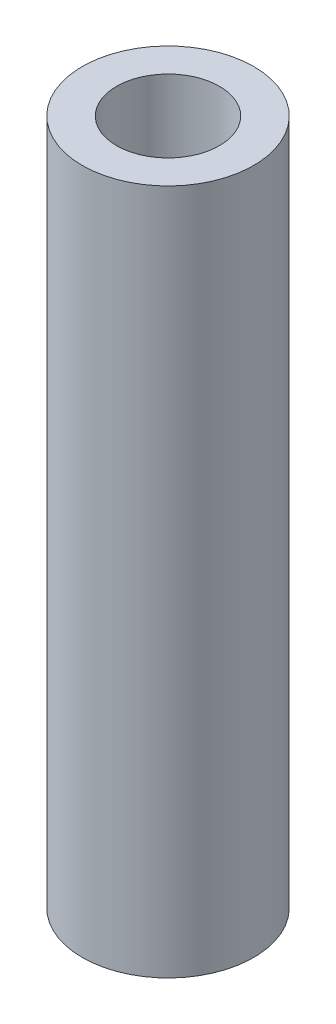
ISO-10303-21;
HEADER;
FILE_DESCRIPTION(('STEP AP214'),'2;1');
FILE_NAME('part.step','',(''),(''),'','','');
FILE_SCHEMA(('AUTOMOTIVE_DESIGN { 1 0 10303 214 1 1 1 1 }'));
ENDSEC;
DATA;
#1=APPLICATION_CONTEXT('core data for automotive mechanical design processes');
#2=APPLICATION_PROTOCOL_DEFINITION('international standard','automotive_design',2000,#1);
#3=PRODUCT_CONTEXT('',#1,'mechanical');
#4=PRODUCT('Part','Part','',(#3));
#5=PRODUCT_RELATED_PRODUCT_CATEGORY('part','',(#4));
#6=PRODUCT_DEFINITION_FORMATION('','',#4);
#7=PRODUCT_DEFINITION_CONTEXT('part definition',#1,'design');
#8=PRODUCT_DEFINITION('design','',#6,#7);
#9=PRODUCT_DEFINITION_SHAPE('','',#8);
#10=(LENGTH_UNIT() NAMED_UNIT(*) SI_UNIT(.MILLI.,.METRE.));
#11=(NAMED_UNIT(*) PLANE_ANGLE_UNIT() SI_UNIT($,.RADIAN.));
#12=(NAMED_UNIT(*) SI_UNIT($,.STERADIAN.) SOLID_ANGLE_UNIT());
#13=UNCERTAINTY_MEASURE_WITH_UNIT(LENGTH_MEASURE(1.E-05),#10,'distance_accuracy_value','');
#14=(GEOMETRIC_REPRESENTATION_CONTEXT(3) GLOBAL_UNCERTAINTY_ASSIGNED_CONTEXT((#13)) GLOBAL_UNIT_ASSIGNED_CONTEXT((#10,
#11,#12)) REPRESENTATION_CONTEXT('',''));
#15=CARTESIAN_POINT('',(0.,0.,0.));
#16=DIRECTION('',(0.,0.,1.));
#17=DIRECTION('',(1.,0.,0.));
#18=AXIS2_PLACEMENT_3D('',#15,#16,#17);
#19=CARTESIAN_POINT('',(0.,20.,0.));
#20=DIRECTION('',(0.,1.,0.));
#21=DIRECTION('',(0.,0.,1.));
#22=AXIS2_PLACEMENT_3D('',#19,#20,#21);
#23=PLANE('',#22);
#24=CARTESIAN_POINT('',(0.,20.,0.));
#25=DIRECTION('',(0.,1.,0.));
#26=DIRECTION('',(0.,0.,1.));
#27=AXIS2_PLACEMENT_3D('',#24,#25,#26);
#28=CIRCLE('',#27,2.5);
#29=CARTESIAN_POINT('',(0.,20.,2.5));
#30=VERTEX_POINT('',#29);
#31=EDGE_CURVE('E10',#30,#30,#28,.T.);
#32=ORIENTED_EDGE('',*,*,#31,.T.);
#33=EDGE_LOOP('',(#32));
#34=FACE_BOUND('',#33,.T.);
#35=CARTESIAN_POINT('',(0.,20.,0.));
#36=DIRECTION('',(0.,1.,0.));
#37=DIRECTION('',(0.,0.,1.));
#38=AXIS2_PLACEMENT_3D('',#35,#36,#37);
#39=CIRCLE('',#38,1.5);
#40=CARTESIAN_POINT('',(0.,20.,1.5));
#41=VERTEX_POINT('',#40);
#42=EDGE_CURVE('E47',#41,#41,#39,.T.);
#43=ORIENTED_EDGE('',*,*,#42,.F.);
#44=EDGE_LOOP('',(#43));
#45=FACE_BOUND('',#44,.T.);
#46=ADVANCED_FACE('F35',(#34,#45),#23,.T.);
#47=CARTESIAN_POINT('',(0.,0.,0.));
#48=DIRECTION('',(0.,1.,0.));
#49=DIRECTION('',(0.,0.,1.));
#50=AXIS2_PLACEMENT_3D('',#47,#48,#49);
#51=PLANE('',#50);
#52=CARTESIAN_POINT('',(0.,0.,0.));
#53=DIRECTION('',(0.,1.,0.));
#54=DIRECTION('',(0.,0.,1.));
#55=AXIS2_PLACEMENT_3D('',#52,#53,#54);
#56=CIRCLE('',#55,2.5);
#57=CARTESIAN_POINT('',(0.,0.,2.5));
#58=VERTEX_POINT('',#57);
#59=EDGE_CURVE('E39',#58,#58,#56,.T.);
#60=ORIENTED_EDGE('',*,*,#59,.F.);
#61=EDGE_LOOP('',(#60));
#62=FACE_BOUND('',#61,.T.);
#63=CARTESIAN_POINT('',(0.,0.,0.));
#64=DIRECTION('',(0.,1.,0.));
#65=DIRECTION('',(0.,0.,1.));
#66=AXIS2_PLACEMENT_3D('',#63,#64,#65);
#67=CIRCLE('',#66,1.5);
#68=CARTESIAN_POINT('',(0.,0.,1.5));
#69=VERTEX_POINT('',#68);
#70=EDGE_CURVE('E49',#69,#69,#67,.T.);
#71=ORIENTED_EDGE('',*,*,#70,.T.);
#72=EDGE_LOOP('',(#71));
#73=FACE_BOUND('',#72,.T.);
#74=ADVANCED_FACE('F60',(#62,#73),#51,.F.);
#75=CARTESIAN_POINT('',(0.,20.,0.));
#76=DIRECTION('',(0.,-1.,0.));
#77=DIRECTION('',(0.,0.,-1.));
#78=AXIS2_PLACEMENT_3D('',#75,#76,#77);
#79=CYLINDRICAL_SURFACE('',#78,2.5);
#80=ORIENTED_EDGE('',*,*,#31,.F.);
#81=EDGE_LOOP('',(#80));
#82=FACE_BOUND('',#81,.T.);
#83=ORIENTED_EDGE('',*,*,#59,.T.);
#84=EDGE_LOOP('',(#83));
#85=FACE_BOUND('',#84,.T.);
#86=ADVANCED_FACE('F37',(#82,#85),#79,.T.);
#87=CARTESIAN_POINT('',(0.,20.,0.));
#88=DIRECTION('',(0.,-1.,0.));
#89=DIRECTION('',(0.,0.,-1.));
#90=AXIS2_PLACEMENT_3D('',#87,#88,#89);
#91=CYLINDRICAL_SURFACE('',#90,1.5);
#92=ORIENTED_EDGE('',*,*,#42,.T.);
#93=EDGE_LOOP('',(#92));
#94=FACE_BOUND('',#93,.T.);
#95=ORIENTED_EDGE('',*,*,#70,.F.);
#96=EDGE_LOOP('',(#95));
#97=FACE_BOUND('',#96,.T.);
#98=ADVANCED_FACE('F56',(#94,#97),#91,.F.);
#99=CLOSED_SHELL('',(#46,#74,#86,#98));
#100=MANIFOLD_SOLID_BREP('B2',#99);
#101=ADVANCED_BREP_SHAPE_REPRESENTATION('',(#18,#100),#14);
#102=SHAPE_DEFINITION_REPRESENTATION(#9,#101);
ENDSEC;
END-ISO-10303-21;
